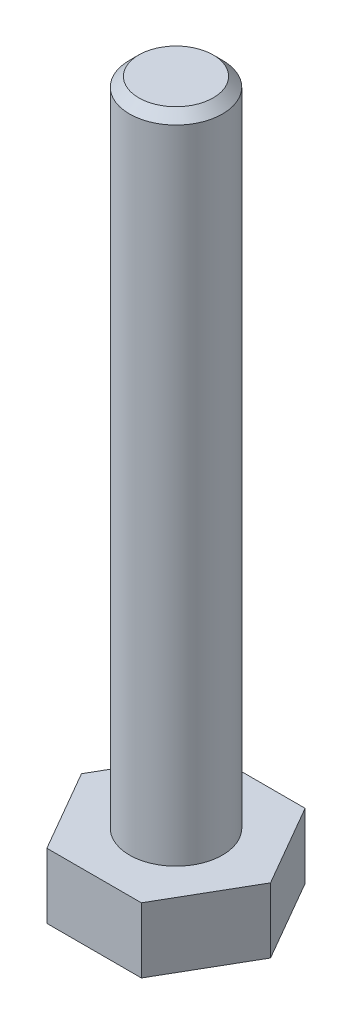
ISO-10303-21;
HEADER;
FILE_DESCRIPTION(('STEP AP214'),'2;1');
FILE_NAME('part.step','',(''),(''),'','','');
FILE_SCHEMA(('AUTOMOTIVE_DESIGN { 1 0 10303 214 1 1 1 1 }'));
ENDSEC;
DATA;
#1=APPLICATION_CONTEXT('core data for automotive mechanical design processes');
#2=APPLICATION_PROTOCOL_DEFINITION('international standard','automotive_design',2000,#1);
#3=PRODUCT_CONTEXT('',#1,'mechanical');
#4=PRODUCT('Part','Part','',(#3));
#5=PRODUCT_RELATED_PRODUCT_CATEGORY('part','',(#4));
#6=PRODUCT_DEFINITION_FORMATION('','',#4);
#7=PRODUCT_DEFINITION_CONTEXT('part definition',#1,'design');
#8=PRODUCT_DEFINITION('design','',#6,#7);
#9=PRODUCT_DEFINITION_SHAPE('','',#8);
#10=(LENGTH_UNIT() NAMED_UNIT(*) SI_UNIT(.MILLI.,.METRE.));
#11=(NAMED_UNIT(*) PLANE_ANGLE_UNIT() SI_UNIT($,.RADIAN.));
#12=(NAMED_UNIT(*) SI_UNIT($,.STERADIAN.) SOLID_ANGLE_UNIT());
#13=UNCERTAINTY_MEASURE_WITH_UNIT(LENGTH_MEASURE(1.E-05),#10,'distance_accuracy_value','');
#14=(GEOMETRIC_REPRESENTATION_CONTEXT(3) GLOBAL_UNCERTAINTY_ASSIGNED_CONTEXT((#13)) GLOBAL_UNIT_ASSIGNED_CONTEXT((#10,
#11,#12)) REPRESENTATION_CONTEXT('',''));
#15=CARTESIAN_POINT('',(0.,0.,0.));
#16=DIRECTION('',(0.,0.,1.));
#17=DIRECTION('',(1.,0.,0.));
#18=AXIS2_PLACEMENT_3D('',#15,#16,#17);
#19=CARTESIAN_POINT('',(-3.81051177665153,3.5,2.2));
#20=DIRECTION('',(0.866025403784439,0.,-0.5));
#21=DIRECTION('',(-0.5,0.,-0.866025403784439));
#22=AXIS2_PLACEMENT_3D('',#19,#20,#21);
#23=PLANE('',#22);
#24=DIRECTION('',(0.5,0.,0.866025403784439));
#25=VECTOR('',#24,1.);
#26=CARTESIAN_POINT('',(-3.81051177665153,0.,2.2));
#27=LINE('',#26,#25);
#28=CARTESIAN_POINT('',(-5.08068236886871,0.,0.));
#29=VERTEX_POINT('',#28);
#30=CARTESIAN_POINT('',(-2.54034118443435,0.,4.4));
#31=VERTEX_POINT('',#30);
#32=EDGE_CURVE('E120',#29,#31,#27,.T.);
#33=ORIENTED_EDGE('',*,*,#32,.T.);
#34=DIRECTION('',(0.,-1.,0.));
#35=VECTOR('',#34,1.);
#36=CARTESIAN_POINT('',(-2.54034118443435,3.5,4.4));
#37=LINE('',#36,#35);
#38=CARTESIAN_POINT('',(-2.54034118443435,3.5,4.4));
#39=VERTEX_POINT('',#38);
#40=EDGE_CURVE('E137',#39,#31,#37,.T.);
#41=ORIENTED_EDGE('',*,*,#40,.F.);
#42=DIRECTION('',(0.5,0.,0.866025403784439));
#43=VECTOR('',#42,1.);
#44=CARTESIAN_POINT('',(-3.81051177665153,3.5,2.2));
#45=LINE('',#44,#43);
#46=CARTESIAN_POINT('',(-5.08068236886871,3.5,0.));
#47=VERTEX_POINT('',#46);
#48=EDGE_CURVE('E130',#47,#39,#45,.T.);
#49=ORIENTED_EDGE('',*,*,#48,.F.);
#50=DIRECTION('',(0.,-1.,0.));
#51=VECTOR('',#50,1.);
#52=CARTESIAN_POINT('',(-5.08068236886871,3.5,0.));
#53=LINE('',#52,#51);
#54=EDGE_CURVE('E116',#47,#29,#53,.T.);
#55=ORIENTED_EDGE('',*,*,#54,.T.);
#56=EDGE_LOOP('',(#33,#41,#49,#55));
#57=FACE_BOUND('',#56,.T.);
#58=ADVANCED_FACE('F34',(#57),#23,.F.);
#59=CARTESIAN_POINT('',(0.,3.5,4.4));
#60=DIRECTION('',(0.,0.,-1.));
#61=DIRECTION('',(-1.,0.,0.));
#62=AXIS2_PLACEMENT_3D('',#59,#60,#61);
#63=PLANE('',#62);
#64=DIRECTION('',(1.,0.,0.));
#65=VECTOR('',#64,1.);
#66=CARTESIAN_POINT('',(0.,0.,4.4));
#67=LINE('',#66,#65);
#68=CARTESIAN_POINT('',(2.54034118443436,0.,4.4));
#69=VERTEX_POINT('',#68);
#70=EDGE_CURVE('E123',#31,#69,#67,.T.);
#71=ORIENTED_EDGE('',*,*,#70,.T.);
#72=DIRECTION('',(0.,-1.,0.));
#73=VECTOR('',#72,1.);
#74=CARTESIAN_POINT('',(2.54034118443436,3.5,4.4));
#75=LINE('',#74,#73);
#76=CARTESIAN_POINT('',(2.54034118443436,3.5,4.4));
#77=VERTEX_POINT('',#76);
#78=EDGE_CURVE('E134',#77,#69,#75,.T.);
#79=ORIENTED_EDGE('',*,*,#78,.F.);
#80=DIRECTION('',(1.,0.,0.));
#81=VECTOR('',#80,1.);
#82=CARTESIAN_POINT('',(0.,3.5,4.4));
#83=LINE('',#82,#81);
#84=EDGE_CURVE('E89',#39,#77,#83,.T.);
#85=ORIENTED_EDGE('',*,*,#84,.F.);
#86=ORIENTED_EDGE('',*,*,#40,.T.);
#87=EDGE_LOOP('',(#71,#79,#85,#86));
#88=FACE_BOUND('',#87,.T.);
#89=ADVANCED_FACE('F150',(#88),#63,.F.);
#90=CARTESIAN_POINT('',(3.81051177665153,3.5,2.2));
#91=DIRECTION('',(-0.866025403784439,0.,-0.5));
#92=DIRECTION('',(-0.5,0.,0.866025403784439));
#93=AXIS2_PLACEMENT_3D('',#90,#91,#92);
#94=PLANE('',#93);
#95=DIRECTION('',(0.5,0.,-0.866025403784439));
#96=VECTOR('',#95,1.);
#97=CARTESIAN_POINT('',(3.81051177665153,0.,2.2));
#98=LINE('',#97,#96);
#99=CARTESIAN_POINT('',(5.08068236886871,0.,0.));
#100=VERTEX_POINT('',#99);
#101=EDGE_CURVE('E125',#69,#100,#98,.T.);
#102=ORIENTED_EDGE('',*,*,#101,.T.);
#103=DIRECTION('',(0.,-1.,0.));
#104=VECTOR('',#103,1.);
#105=CARTESIAN_POINT('',(5.08068236886871,3.5,0.));
#106=LINE('',#105,#104);
#107=CARTESIAN_POINT('',(5.08068236886871,3.5,0.));
#108=VERTEX_POINT('',#107);
#109=EDGE_CURVE('E111',#108,#100,#106,.T.);
#110=ORIENTED_EDGE('',*,*,#109,.F.);
#111=DIRECTION('',(0.5,0.,-0.866025403784439));
#112=VECTOR('',#111,1.);
#113=CARTESIAN_POINT('',(3.81051177665153,3.5,2.2));
#114=LINE('',#113,#112);
#115=EDGE_CURVE('E102',#77,#108,#114,.T.);
#116=ORIENTED_EDGE('',*,*,#115,.F.);
#117=ORIENTED_EDGE('',*,*,#78,.T.);
#118=EDGE_LOOP('',(#102,#110,#116,#117));
#119=FACE_BOUND('',#118,.T.);
#120=ADVANCED_FACE('F153',(#119),#94,.F.);
#121=CARTESIAN_POINT('',(3.81051177665153,3.5,-2.2));
#122=DIRECTION('',(-0.866025403784439,0.,0.5));
#123=DIRECTION('',(0.5,0.,0.866025403784439));
#124=AXIS2_PLACEMENT_3D('',#121,#122,#123);
#125=PLANE('',#124);
#126=DIRECTION('',(-0.5,0.,-0.866025403784439));
#127=VECTOR('',#126,1.);
#128=CARTESIAN_POINT('',(3.81051177665153,0.,-2.2));
#129=LINE('',#128,#127);
#130=CARTESIAN_POINT('',(2.54034118443436,0.,-4.4));
#131=VERTEX_POINT('',#130);
#132=EDGE_CURVE('E110',#100,#131,#129,.T.);
#133=ORIENTED_EDGE('',*,*,#132,.T.);
#134=DIRECTION('',(0.,-1.,0.));
#135=VECTOR('',#134,1.);
#136=CARTESIAN_POINT('',(2.54034118443436,3.5,-4.4));
#137=LINE('',#136,#135);
#138=CARTESIAN_POINT('',(2.54034118443436,3.5,-4.4));
#139=VERTEX_POINT('',#138);
#140=EDGE_CURVE('E107',#139,#131,#137,.T.);
#141=ORIENTED_EDGE('',*,*,#140,.F.);
#142=DIRECTION('',(-0.5,0.,-0.866025403784439));
#143=VECTOR('',#142,1.);
#144=CARTESIAN_POINT('',(3.81051177665153,3.5,-2.2));
#145=LINE('',#144,#143);
#146=EDGE_CURVE('E96',#108,#139,#145,.T.);
#147=ORIENTED_EDGE('',*,*,#146,.F.);
#148=ORIENTED_EDGE('',*,*,#109,.T.);
#149=EDGE_LOOP('',(#133,#141,#147,#148));
#150=FACE_BOUND('',#149,.T.);
#151=ADVANCED_FACE('F108',(#150),#125,.F.);
#152=CARTESIAN_POINT('',(0.,3.5,-4.4));
#153=DIRECTION('',(0.,0.,1.));
#154=DIRECTION('',(1.,0.,0.));
#155=AXIS2_PLACEMENT_3D('',#152,#153,#154);
#156=PLANE('',#155);
#157=DIRECTION('',(-1.,0.,0.));
#158=VECTOR('',#157,1.);
#159=CARTESIAN_POINT('',(0.,0.,-4.4));
#160=LINE('',#159,#158);
#161=CARTESIAN_POINT('',(-2.54034118443435,0.,-4.4));
#162=VERTEX_POINT('',#161);
#163=EDGE_CURVE('E74',#131,#162,#160,.T.);
#164=ORIENTED_EDGE('',*,*,#163,.T.);
#165=DIRECTION('',(0.,-1.,0.));
#166=VECTOR('',#165,1.);
#167=CARTESIAN_POINT('',(-2.54034118443435,3.5,-4.4));
#168=LINE('',#167,#166);
#169=CARTESIAN_POINT('',(-2.54034118443435,3.5,-4.4));
#170=VERTEX_POINT('',#169);
#171=EDGE_CURVE('E112',#170,#162,#168,.T.);
#172=ORIENTED_EDGE('',*,*,#171,.F.);
#173=DIRECTION('',(-1.,0.,0.));
#174=VECTOR('',#173,1.);
#175=CARTESIAN_POINT('',(0.,3.5,-4.4));
#176=LINE('',#175,#174);
#177=EDGE_CURVE('E100',#139,#170,#176,.T.);
#178=ORIENTED_EDGE('',*,*,#177,.F.);
#179=ORIENTED_EDGE('',*,*,#140,.T.);
#180=EDGE_LOOP('',(#164,#172,#178,#179));
#181=FACE_BOUND('',#180,.T.);
#182=ADVANCED_FACE('F114',(#181),#156,.F.);
#183=CARTESIAN_POINT('',(-3.81051177665153,3.5,-2.2));
#184=DIRECTION('',(0.866025403784439,0.,0.5));
#185=DIRECTION('',(0.5,0.,-0.866025403784439));
#186=AXIS2_PLACEMENT_3D('',#183,#184,#185);
#187=PLANE('',#186);
#188=DIRECTION('',(-0.5,0.,0.866025403784439));
#189=VECTOR('',#188,1.);
#190=CARTESIAN_POINT('',(-3.81051177665153,0.,-2.2));
#191=LINE('',#190,#189);
#192=EDGE_CURVE('E80',#162,#29,#191,.T.);
#193=ORIENTED_EDGE('',*,*,#192,.T.);
#194=ORIENTED_EDGE('',*,*,#54,.F.);
#195=DIRECTION('',(-0.5,0.,0.866025403784439));
#196=VECTOR('',#195,1.);
#197=CARTESIAN_POINT('',(-3.81051177665153,3.5,-2.2));
#198=LINE('',#197,#196);
#199=EDGE_CURVE('E51',#170,#47,#198,.T.);
#200=ORIENTED_EDGE('',*,*,#199,.F.);
#201=ORIENTED_EDGE('',*,*,#171,.T.);
#202=EDGE_LOOP('',(#193,#194,#200,#201));
#203=FACE_BOUND('',#202,.T.);
#204=ADVANCED_FACE('F158',(#203),#187,.F.);
#205=CARTESIAN_POINT('',(0.,3.5,0.));
#206=DIRECTION('',(0.,1.,0.));
#207=DIRECTION('',(0.,0.,1.));
#208=AXIS2_PLACEMENT_3D('',#205,#206,#207);
#209=PLANE('',#208);
#210=CARTESIAN_POINT('',(0.,3.5,0.));
#211=DIRECTION('',(0.,1.,0.));
#212=DIRECTION('',(0.,0.,1.));
#213=AXIS2_PLACEMENT_3D('',#210,#211,#212);
#214=CIRCLE('',#213,2.5);
#215=CARTESIAN_POINT('',(0.,3.5,2.5));
#216=VERTEX_POINT('',#215);
#217=EDGE_CURVE('E138',#216,#216,#214,.T.);
#218=ORIENTED_EDGE('',*,*,#217,.F.);
#219=EDGE_LOOP('',(#218));
#220=FACE_BOUND('',#219,.T.);
#221=ORIENTED_EDGE('',*,*,#48,.T.);
#222=ORIENTED_EDGE('',*,*,#84,.T.);
#223=ORIENTED_EDGE('',*,*,#115,.T.);
#224=ORIENTED_EDGE('',*,*,#146,.T.);
#225=ORIENTED_EDGE('',*,*,#177,.T.);
#226=ORIENTED_EDGE('',*,*,#199,.T.);
#227=EDGE_LOOP('',(#221,#222,#223,#224,#225,#226));
#228=FACE_BOUND('',#227,.T.);
#229=ADVANCED_FACE('F98',(#220,#228),#209,.T.);
#230=CARTESIAN_POINT('',(0.,0.,0.));
#231=DIRECTION('',(0.,1.,0.));
#232=DIRECTION('',(0.,0.,1.));
#233=AXIS2_PLACEMENT_3D('',#230,#231,#232);
#234=PLANE('',#233);
#235=ORIENTED_EDGE('',*,*,#32,.F.);
#236=ORIENTED_EDGE('',*,*,#192,.F.);
#237=ORIENTED_EDGE('',*,*,#163,.F.);
#238=ORIENTED_EDGE('',*,*,#132,.F.);
#239=ORIENTED_EDGE('',*,*,#101,.F.);
#240=ORIENTED_EDGE('',*,*,#70,.F.);
#241=EDGE_LOOP('',(#235,#236,#237,#238,#239,#240));
#242=FACE_BOUND('',#241,.T.);
#243=ADVANCED_FACE('F156',(#242),#234,.F.);
#244=CARTESIAN_POINT('',(0.,38.5,0.));
#245=DIRECTION('',(0.,-1.,0.));
#246=DIRECTION('',(0.,0.,-1.));
#247=AXIS2_PLACEMENT_3D('',#244,#245,#246);
#248=CYLINDRICAL_SURFACE('',#247,2.5);
#249=CARTESIAN_POINT('',(0.,38.,0.));
#250=DIRECTION('',(0.,1.,0.));
#251=DIRECTION('',(0.,0.,1.));
#252=AXIS2_PLACEMENT_3D('',#249,#250,#251);
#253=CIRCLE('',#252,2.5);
#254=CARTESIAN_POINT('',(0.,38.,2.5));
#255=VERTEX_POINT('',#254);
#256=EDGE_CURVE('E11',#255,#255,#253,.F.);
#257=ORIENTED_EDGE('',*,*,#256,.T.);
#258=EDGE_LOOP('',(#257));
#259=FACE_BOUND('',#258,.T.);
#260=ORIENTED_EDGE('',*,*,#217,.T.);
#261=EDGE_LOOP('',(#260));
#262=FACE_BOUND('',#261,.T.);
#263=ADVANCED_FACE('F200',(#259,#262),#248,.T.);
#264=CARTESIAN_POINT('',(0.,38.5,0.));
#265=DIRECTION('',(0.,1.,0.));
#266=DIRECTION('',(0.,0.,1.));
#267=AXIS2_PLACEMENT_3D('',#264,#265,#266);
#268=PLANE('',#267);
#269=CARTESIAN_POINT('',(0.,38.5,0.));
#270=DIRECTION('',(0.,1.,0.));
#271=DIRECTION('',(0.,0.,1.));
#272=AXIS2_PLACEMENT_3D('',#269,#270,#271);
#273=CIRCLE('',#272,1.99999999999999);
#274=CARTESIAN_POINT('',(0.,38.5,1.99999999999999));
#275=VERTEX_POINT('',#274);
#276=EDGE_CURVE('E43',#275,#275,#273,.T.);
#277=ORIENTED_EDGE('',*,*,#276,.T.);
#278=EDGE_LOOP('',(#277));
#279=FACE_BOUND('',#278,.T.);
#280=ADVANCED_FACE('F213',(#279),#268,.T.);
#281=CARTESIAN_POINT('',(0.,38.5,0.));
#282=DIRECTION('',(0.,-1.,0.));
#283=DIRECTION('',(0.,0.,-1.));
#284=AXIS2_PLACEMENT_3D('',#281,#282,#283);
#285=CONICAL_SURFACE('',#284,1.99999999999999,0.785398163397446);
#286=ORIENTED_EDGE('',*,*,#256,.F.);
#287=EDGE_LOOP('',(#286));
#288=FACE_BOUND('',#287,.T.);
#289=ORIENTED_EDGE('',*,*,#276,.F.);
#290=EDGE_LOOP('',(#289));
#291=FACE_BOUND('',#290,.T.);
#292=ADVANCED_FACE('F36',(#288,#291),#285,.T.);
#293=CLOSED_SHELL('',(#58,#89,#120,#151,#182,#204,#229,#243,#263,#280,#292));
#294=MANIFOLD_SOLID_BREP('B2',#293);
#295=ADVANCED_BREP_SHAPE_REPRESENTATION('',(#18,#294),#14);
#296=SHAPE_DEFINITION_REPRESENTATION(#9,#295);
ENDSEC;
END-ISO-10303-21;
